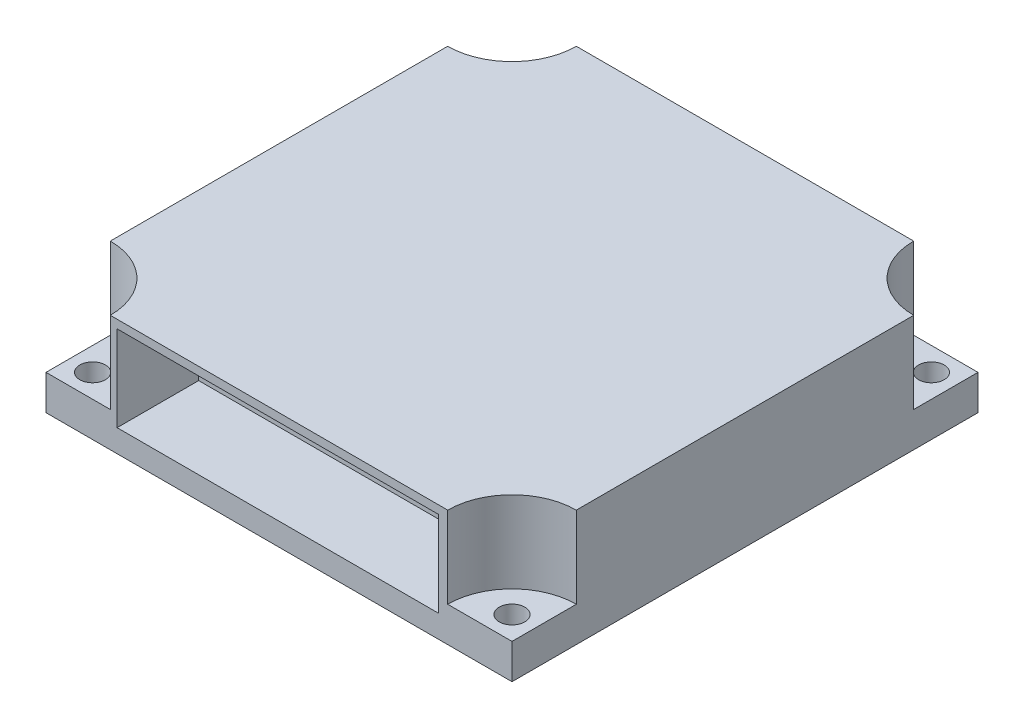
ISO-10303-21;
HEADER;
FILE_DESCRIPTION(('STEP AP214'),'2;1');
FILE_NAME('part.step','',(''),(''),'','','');
FILE_SCHEMA(('AUTOMOTIVE_DESIGN { 1 0 10303 214 1 1 1 1 }'));
ENDSEC;
DATA;
#1=APPLICATION_CONTEXT('core data for automotive mechanical design processes');
#2=APPLICATION_PROTOCOL_DEFINITION('international standard','automotive_design',2000,#1);
#3=PRODUCT_CONTEXT('',#1,'mechanical');
#4=PRODUCT('Part','Part','',(#3));
#5=PRODUCT_RELATED_PRODUCT_CATEGORY('part','',(#4));
#6=PRODUCT_DEFINITION_FORMATION('','',#4);
#7=PRODUCT_DEFINITION_CONTEXT('part definition',#1,'design');
#8=PRODUCT_DEFINITION('design','',#6,#7);
#9=PRODUCT_DEFINITION_SHAPE('','',#8);
#10=(LENGTH_UNIT() NAMED_UNIT(*) SI_UNIT(.MILLI.,.METRE.));
#11=(NAMED_UNIT(*) PLANE_ANGLE_UNIT() SI_UNIT($,.RADIAN.));
#12=(NAMED_UNIT(*) SI_UNIT($,.STERADIAN.) SOLID_ANGLE_UNIT());
#13=UNCERTAINTY_MEASURE_WITH_UNIT(LENGTH_MEASURE(1.E-05),#10,'distance_accuracy_value','');
#14=(GEOMETRIC_REPRESENTATION_CONTEXT(3) GLOBAL_UNCERTAINTY_ASSIGNED_CONTEXT((#13)) GLOBAL_UNIT_ASSIGNED_CONTEXT((#10,
#11,#12)) REPRESENTATION_CONTEXT('',''));
#15=CARTESIAN_POINT('',(0.,0.,0.));
#16=DIRECTION('',(0.,0.,1.));
#17=DIRECTION('',(1.,0.,0.));
#18=AXIS2_PLACEMENT_3D('',#15,#16,#17);
#19=CARTESIAN_POINT('',(0.,10.,0.));
#20=DIRECTION('',(0.,-1.,0.));
#21=DIRECTION('',(0.,0.,-1.));
#22=AXIS2_PLACEMENT_3D('',#19,#20,#21);
#23=PLANE('',#22);
#24=DIRECTION('',(0.,0.,1.));
#25=VECTOR('',#24,1.);
#26=CARTESIAN_POINT('',(0.,10.,0.));
#27=LINE('',#26,#25);
#28=CARTESIAN_POINT('',(0.,10.,-34.4807190282554));
#29=VERTEX_POINT('',#28);
#30=CARTESIAN_POINT('',(0.,10.,-5.51928097174457));
#31=VERTEX_POINT('',#30);
#32=EDGE_CURVE('E252',#29,#31,#27,.T.);
#33=ORIENTED_EDGE('',*,*,#32,.T.);
#34=CARTESIAN_POINT('',(0.,10.,0.));
#35=DIRECTION('',(0.,1.,0.));
#36=DIRECTION('',(0.,0.,-1.));
#37=AXIS2_PLACEMENT_3D('',#34,#35,#36);
#38=CIRCLE('',#37,5.51928097174457);
#39=CARTESIAN_POINT('',(5.51928097174457,10.,0.));
#40=VERTEX_POINT('',#39);
#41=EDGE_CURVE('E182',#40,#31,#38,.T.);
#42=ORIENTED_EDGE('',*,*,#41,.F.);
#43=DIRECTION('',(1.,0.,0.));
#44=VECTOR('',#43,1.);
#45=CARTESIAN_POINT('',(0.,10.,0.));
#46=LINE('',#45,#44);
#47=CARTESIAN_POINT('',(34.4807190282554,10.,0.));
#48=VERTEX_POINT('',#47);
#49=EDGE_CURVE('E255',#40,#48,#46,.T.);
#50=ORIENTED_EDGE('',*,*,#49,.T.);
#51=CARTESIAN_POINT('',(40.,10.,0.));
#52=DIRECTION('',(0.,1.,0.));
#53=DIRECTION('',(0.,0.,-1.));
#54=AXIS2_PLACEMENT_3D('',#51,#52,#53);
#55=CIRCLE('',#54,5.51928097174457);
#56=CARTESIAN_POINT('',(40.,10.,-5.51928097174455));
#57=VERTEX_POINT('',#56);
#58=EDGE_CURVE('E205',#57,#48,#55,.T.);
#59=ORIENTED_EDGE('',*,*,#58,.F.);
#60=DIRECTION('',(0.,0.,-1.));
#61=VECTOR('',#60,1.);
#62=CARTESIAN_POINT('',(40.,10.,0.));
#63=LINE('',#62,#61);
#64=CARTESIAN_POINT('',(40.,10.,-34.4807190282554));
#65=VERTEX_POINT('',#64);
#66=EDGE_CURVE('E259',#57,#65,#63,.T.);
#67=ORIENTED_EDGE('',*,*,#66,.T.);
#68=CARTESIAN_POINT('',(40.,10.,-40.));
#69=DIRECTION('',(0.,1.,0.));
#70=DIRECTION('',(0.,0.,-1.));
#71=AXIS2_PLACEMENT_3D('',#68,#69,#70);
#72=CIRCLE('',#71,5.51928097174457);
#73=CARTESIAN_POINT('',(34.4807190282554,10.,-40.));
#74=VERTEX_POINT('',#73);
#75=EDGE_CURVE('E189',#74,#65,#72,.T.);
#76=ORIENTED_EDGE('',*,*,#75,.F.);
#77=DIRECTION('',(-1.,0.,0.));
#78=VECTOR('',#77,1.);
#79=CARTESIAN_POINT('',(0.,10.,-40.));
#80=LINE('',#79,#78);
#81=CARTESIAN_POINT('',(5.51928097174457,10.,-40.));
#82=VERTEX_POINT('',#81);
#83=EDGE_CURVE('E262',#74,#82,#80,.T.);
#84=ORIENTED_EDGE('',*,*,#83,.T.);
#85=CARTESIAN_POINT('',(0.,10.,-40.));
#86=DIRECTION('',(0.,1.,0.));
#87=DIRECTION('',(0.,0.,-1.));
#88=AXIS2_PLACEMENT_3D('',#85,#86,#87);
#89=CIRCLE('',#88,5.51928097174457);
#90=EDGE_CURVE('E200',#29,#82,#89,.T.);
#91=ORIENTED_EDGE('',*,*,#90,.F.);
#92=EDGE_LOOP('',(#33,#42,#50,#59,#67,#76,#84,#91));
#93=FACE_BOUND('',#92,.T.);
#94=ADVANCED_FACE('F32',(#93),#23,.F.);
#95=CARTESIAN_POINT('',(0.,0.,0.));
#96=DIRECTION('',(0.,-1.,0.));
#97=DIRECTION('',(0.,0.,-1.));
#98=AXIS2_PLACEMENT_3D('',#95,#96,#97);
#99=PLANE('',#98);
#100=CARTESIAN_POINT('',(2.,0.,-1.99999999999999));
#101=DIRECTION('',(0.,1.,0.));
#102=DIRECTION('',(0.,0.,1.));
#103=AXIS2_PLACEMENT_3D('',#100,#101,#102);
#104=CIRCLE('',#103,1.1);
#105=CARTESIAN_POINT('',(2.,0.,-0.899999999999996));
#106=VERTEX_POINT('',#105);
#107=EDGE_CURVE('E242',#106,#106,#104,.T.);
#108=ORIENTED_EDGE('',*,*,#107,.T.);
#109=EDGE_LOOP('',(#108));
#110=FACE_BOUND('',#109,.T.);
#111=CARTESIAN_POINT('',(2.,0.,-38.));
#112=DIRECTION('',(0.,1.,0.));
#113=DIRECTION('',(0.,0.,1.));
#114=AXIS2_PLACEMENT_3D('',#111,#112,#113);
#115=CIRCLE('',#114,1.1);
#116=CARTESIAN_POINT('',(2.,0.,-36.9));
#117=VERTEX_POINT('',#116);
#118=EDGE_CURVE('E248',#117,#117,#115,.T.);
#119=ORIENTED_EDGE('',*,*,#118,.T.);
#120=EDGE_LOOP('',(#119));
#121=FACE_BOUND('',#120,.T.);
#122=DIRECTION('',(0.,0.,1.));
#123=VECTOR('',#122,1.);
#124=CARTESIAN_POINT('',(0.,0.,0.));
#125=LINE('',#124,#123);
#126=CARTESIAN_POINT('',(0.,0.,-40.));
#127=VERTEX_POINT('',#126);
#128=CARTESIAN_POINT('',(0.,0.,0.));
#129=VERTEX_POINT('',#128);
#130=EDGE_CURVE('E251',#127,#129,#125,.T.);
#131=ORIENTED_EDGE('',*,*,#130,.F.);
#132=DIRECTION('',(-1.,0.,0.));
#133=VECTOR('',#132,1.);
#134=CARTESIAN_POINT('',(0.,0.,-40.));
#135=LINE('',#134,#133);
#136=CARTESIAN_POINT('',(40.,0.,-40.));
#137=VERTEX_POINT('',#136);
#138=EDGE_CURVE('E256',#137,#127,#135,.T.);
#139=ORIENTED_EDGE('',*,*,#138,.F.);
#140=DIRECTION('',(0.,0.,-1.));
#141=VECTOR('',#140,1.);
#142=CARTESIAN_POINT('',(40.,0.,0.));
#143=LINE('',#142,#141);
#144=CARTESIAN_POINT('',(40.,0.,0.));
#145=VERTEX_POINT('',#144);
#146=EDGE_CURVE('E271',#145,#137,#143,.T.);
#147=ORIENTED_EDGE('',*,*,#146,.F.);
#148=DIRECTION('',(1.,0.,0.));
#149=VECTOR('',#148,1.);
#150=CARTESIAN_POINT('',(0.,0.,0.));
#151=LINE('',#150,#149);
#152=EDGE_CURVE('E268',#129,#145,#151,.T.);
#153=ORIENTED_EDGE('',*,*,#152,.F.);
#154=EDGE_LOOP('',(#131,#139,#147,#153));
#155=FACE_BOUND('',#154,.T.);
#156=CARTESIAN_POINT('',(38.,0.,-38.));
#157=DIRECTION('',(0.,1.,0.));
#158=DIRECTION('',(0.,0.,1.));
#159=AXIS2_PLACEMENT_3D('',#156,#157,#158);
#160=CIRCLE('',#159,1.1);
#161=CARTESIAN_POINT('',(38.,0.,-36.9));
#162=VERTEX_POINT('',#161);
#163=EDGE_CURVE('E245',#162,#162,#160,.T.);
#164=ORIENTED_EDGE('',*,*,#163,.T.);
#165=EDGE_LOOP('',(#164));
#166=FACE_BOUND('',#165,.T.);
#167=CARTESIAN_POINT('',(38.,0.,-1.99999999999999));
#168=DIRECTION('',(0.,1.,0.));
#169=DIRECTION('',(0.,0.,1.));
#170=AXIS2_PLACEMENT_3D('',#167,#168,#169);
#171=CIRCLE('',#170,1.1);
#172=CARTESIAN_POINT('',(38.,0.,-0.899999999999996));
#173=VERTEX_POINT('',#172);
#174=EDGE_CURVE('E239',#173,#173,#171,.T.);
#175=ORIENTED_EDGE('',*,*,#174,.T.);
#176=EDGE_LOOP('',(#175));
#177=FACE_BOUND('',#176,.T.);
#178=ADVANCED_FACE('F302',(#110,#121,#155,#166,#177),#99,.T.);
#179=CARTESIAN_POINT('',(0.,10.,0.));
#180=DIRECTION('',(1.,0.,0.));
#181=DIRECTION('',(0.,0.,-1.));
#182=AXIS2_PLACEMENT_3D('',#179,#180,#181);
#183=PLANE('',#182);
#184=DIRECTION('',(0.,0.,1.));
#185=VECTOR('',#184,1.);
#186=CARTESIAN_POINT('',(0.,3.,-5.51928097174457));
#187=LINE('',#186,#185);
#188=CARTESIAN_POINT('',(0.,3.,-5.51928097174457));
#189=VERTEX_POINT('',#188);
#190=CARTESIAN_POINT('',(0.,3.,0.));
#191=VERTEX_POINT('',#190);
#192=EDGE_CURVE('E57',#189,#191,#187,.T.);
#193=ORIENTED_EDGE('',*,*,#192,.F.);
#194=DIRECTION('',(0.,1.,0.));
#195=VECTOR('',#194,1.);
#196=CARTESIAN_POINT('',(0.,3.,-5.51928097174457));
#197=LINE('',#196,#195);
#198=EDGE_CURVE('E212',#189,#31,#197,.T.);
#199=ORIENTED_EDGE('',*,*,#198,.T.);
#200=ORIENTED_EDGE('',*,*,#32,.F.);
#201=DIRECTION('',(0.,1.,0.));
#202=VECTOR('',#201,1.);
#203=CARTESIAN_POINT('',(0.,3.,-34.4807190282554));
#204=LINE('',#203,#202);
#205=CARTESIAN_POINT('',(0.,3.,-34.4807190282554));
#206=VERTEX_POINT('',#205);
#207=EDGE_CURVE('E232',#206,#29,#204,.T.);
#208=ORIENTED_EDGE('',*,*,#207,.F.);
#209=DIRECTION('',(0.,0.,1.));
#210=VECTOR('',#209,1.);
#211=CARTESIAN_POINT('',(0.,3.,-40.));
#212=LINE('',#211,#210);
#213=CARTESIAN_POINT('',(0.,3.,-40.));
#214=VERTEX_POINT('',#213);
#215=EDGE_CURVE('E228',#214,#206,#212,.T.);
#216=ORIENTED_EDGE('',*,*,#215,.F.);
#217=DIRECTION('',(0.,-1.,0.));
#218=VECTOR('',#217,1.);
#219=CARTESIAN_POINT('',(0.,10.,-40.));
#220=LINE('',#219,#218);
#221=EDGE_CURVE('E265',#214,#127,#220,.T.);
#222=ORIENTED_EDGE('',*,*,#221,.T.);
#223=ORIENTED_EDGE('',*,*,#130,.T.);
#224=DIRECTION('',(0.,-1.,0.));
#225=VECTOR('',#224,1.);
#226=CARTESIAN_POINT('',(0.,10.,0.));
#227=LINE('',#226,#225);
#228=EDGE_CURVE('E11',#191,#129,#227,.T.);
#229=ORIENTED_EDGE('',*,*,#228,.F.);
#230=EDGE_LOOP('',(#193,#199,#200,#208,#216,#222,#223,#229));
#231=FACE_BOUND('',#230,.T.);
#232=ADVANCED_FACE('F34',(#231),#183,.F.);
#233=CARTESIAN_POINT('',(0.,10.,0.));
#234=DIRECTION('',(0.,0.,-1.));
#235=DIRECTION('',(-1.,0.,0.));
#236=AXIS2_PLACEMENT_3D('',#233,#234,#235);
#237=PLANE('',#236);
#238=DIRECTION('',(1.,0.,0.));
#239=VECTOR('',#238,1.);
#240=CARTESIAN_POINT('',(6.10411725381788,1.93881444528188,0.));
#241=LINE('',#240,#239);
#242=CARTESIAN_POINT('',(6.10411725381788,1.93881444528188,0.));
#243=VERTEX_POINT('',#242);
#244=CARTESIAN_POINT('',(33.6752905984774,1.93881444528188,0.));
#245=VERTEX_POINT('',#244);
#246=EDGE_CURVE('E176',#243,#245,#241,.T.);
#247=ORIENTED_EDGE('',*,*,#246,.F.);
#248=DIRECTION('',(0.,-1.,0.));
#249=VECTOR('',#248,1.);
#250=CARTESIAN_POINT('',(6.10411725381788,9.28673716728667,0.));
#251=LINE('',#250,#249);
#252=CARTESIAN_POINT('',(6.10411725381788,9.28673716728667,0.));
#253=VERTEX_POINT('',#252);
#254=EDGE_CURVE('E49',#253,#243,#251,.T.);
#255=ORIENTED_EDGE('',*,*,#254,.F.);
#256=DIRECTION('',(-1.,0.,0.));
#257=VECTOR('',#256,1.);
#258=CARTESIAN_POINT('',(6.10411725381788,9.28673716728667,0.));
#259=LINE('',#258,#257);
#260=CARTESIAN_POINT('',(33.6752905984774,9.28673716728667,0.));
#261=VERTEX_POINT('',#260);
#262=EDGE_CURVE('E167',#261,#253,#259,.T.);
#263=ORIENTED_EDGE('',*,*,#262,.F.);
#264=DIRECTION('',(0.,1.,0.));
#265=VECTOR('',#264,1.);
#266=CARTESIAN_POINT('',(33.6752905984774,9.28673716728667,0.));
#267=LINE('',#266,#265);
#268=EDGE_CURVE('E170',#245,#261,#267,.T.);
#269=ORIENTED_EDGE('',*,*,#268,.F.);
#270=EDGE_LOOP('',(#247,#255,#263,#269));
#271=FACE_BOUND('',#270,.T.);
#272=ORIENTED_EDGE('',*,*,#49,.F.);
#273=DIRECTION('',(0.,1.,0.));
#274=VECTOR('',#273,1.);
#275=CARTESIAN_POINT('',(5.51928097174457,3.,0.));
#276=LINE('',#275,#274);
#277=CARTESIAN_POINT('',(5.51928097174457,3.,0.));
#278=VERTEX_POINT('',#277);
#279=EDGE_CURVE('E221',#278,#40,#276,.T.);
#280=ORIENTED_EDGE('',*,*,#279,.F.);
#281=DIRECTION('',(1.,0.,0.));
#282=VECTOR('',#281,1.);
#283=CARTESIAN_POINT('',(0.,3.,0.));
#284=LINE('',#283,#282);
#285=EDGE_CURVE('E217',#191,#278,#284,.T.);
#286=ORIENTED_EDGE('',*,*,#285,.F.);
#287=ORIENTED_EDGE('',*,*,#228,.T.);
#288=ORIENTED_EDGE('',*,*,#152,.T.);
#289=DIRECTION('',(0.,-1.,0.));
#290=VECTOR('',#289,1.);
#291=CARTESIAN_POINT('',(40.,10.,0.));
#292=LINE('',#291,#290);
#293=CARTESIAN_POINT('',(40.,3.,0.));
#294=VERTEX_POINT('',#293);
#295=EDGE_CURVE('E41',#294,#145,#292,.T.);
#296=ORIENTED_EDGE('',*,*,#295,.F.);
#297=DIRECTION('',(1.,0.,0.));
#298=VECTOR('',#297,1.);
#299=CARTESIAN_POINT('',(34.4807190282554,3.,0.));
#300=LINE('',#299,#298);
#301=CARTESIAN_POINT('',(34.4807190282554,3.,0.));
#302=VERTEX_POINT('',#301);
#303=EDGE_CURVE('E202',#302,#294,#300,.T.);
#304=ORIENTED_EDGE('',*,*,#303,.F.);
#305=DIRECTION('',(0.,1.,0.));
#306=VECTOR('',#305,1.);
#307=CARTESIAN_POINT('',(34.4807190282554,3.,0.));
#308=LINE('',#307,#306);
#309=EDGE_CURVE('E196',#302,#48,#308,.T.);
#310=ORIENTED_EDGE('',*,*,#309,.T.);
#311=EDGE_LOOP('',(#272,#280,#286,#287,#288,#296,#304,#310));
#312=FACE_BOUND('',#311,.T.);
#313=ADVANCED_FACE('F344',(#271,#312),#237,.F.);
#314=CARTESIAN_POINT('',(40.,10.,0.));
#315=DIRECTION('',(-1.,0.,0.));
#316=DIRECTION('',(0.,0.,1.));
#317=AXIS2_PLACEMENT_3D('',#314,#315,#316);
#318=PLANE('',#317);
#319=ORIENTED_EDGE('',*,*,#66,.F.);
#320=DIRECTION('',(0.,1.,0.));
#321=VECTOR('',#320,1.);
#322=CARTESIAN_POINT('',(40.,3.,-5.51928097174455));
#323=LINE('',#322,#321);
#324=CARTESIAN_POINT('',(40.,3.,-5.51928097174455));
#325=VERTEX_POINT('',#324);
#326=EDGE_CURVE('E210',#325,#57,#323,.T.);
#327=ORIENTED_EDGE('',*,*,#326,.F.);
#328=DIRECTION('',(0.,0.,-1.));
#329=VECTOR('',#328,1.);
#330=CARTESIAN_POINT('',(40.,3.,0.));
#331=LINE('',#330,#329);
#332=EDGE_CURVE('E204',#294,#325,#331,.T.);
#333=ORIENTED_EDGE('',*,*,#332,.F.);
#334=ORIENTED_EDGE('',*,*,#295,.T.);
#335=ORIENTED_EDGE('',*,*,#146,.T.);
#336=DIRECTION('',(0.,-1.,0.));
#337=VECTOR('',#336,1.);
#338=CARTESIAN_POINT('',(40.,10.,-40.));
#339=LINE('',#338,#337);
#340=CARTESIAN_POINT('',(40.,3.,-40.));
#341=VERTEX_POINT('',#340);
#342=EDGE_CURVE('E277',#341,#137,#339,.T.);
#343=ORIENTED_EDGE('',*,*,#342,.F.);
#344=DIRECTION('',(0.,0.,-1.));
#345=VECTOR('',#344,1.);
#346=CARTESIAN_POINT('',(40.,3.,-34.4807190282554));
#347=LINE('',#346,#345);
#348=CARTESIAN_POINT('',(40.,3.,-34.4807190282554));
#349=VERTEX_POINT('',#348);
#350=EDGE_CURVE('E186',#349,#341,#347,.T.);
#351=ORIENTED_EDGE('',*,*,#350,.F.);
#352=DIRECTION('',(0.,1.,0.));
#353=VECTOR('',#352,1.);
#354=CARTESIAN_POINT('',(40.,3.,-34.4807190282554));
#355=LINE('',#354,#353);
#356=EDGE_CURVE('E197',#349,#65,#355,.T.);
#357=ORIENTED_EDGE('',*,*,#356,.T.);
#358=EDGE_LOOP('',(#319,#327,#333,#334,#335,#343,#351,#357));
#359=FACE_BOUND('',#358,.T.);
#360=ADVANCED_FACE('F341',(#359),#318,.F.);
#361=CARTESIAN_POINT('',(0.,10.,-40.));
#362=DIRECTION('',(0.,0.,1.));
#363=DIRECTION('',(1.,0.,0.));
#364=AXIS2_PLACEMENT_3D('',#361,#362,#363);
#365=PLANE('',#364);
#366=ORIENTED_EDGE('',*,*,#83,.F.);
#367=DIRECTION('',(0.,1.,0.));
#368=VECTOR('',#367,1.);
#369=CARTESIAN_POINT('',(34.4807190282554,3.,-40.));
#370=LINE('',#369,#368);
#371=CARTESIAN_POINT('',(34.4807190282554,3.,-40.));
#372=VERTEX_POINT('',#371);
#373=EDGE_CURVE('E194',#372,#74,#370,.T.);
#374=ORIENTED_EDGE('',*,*,#373,.F.);
#375=DIRECTION('',(-1.,0.,0.));
#376=VECTOR('',#375,1.);
#377=CARTESIAN_POINT('',(40.,3.,-40.));
#378=LINE('',#377,#376);
#379=EDGE_CURVE('E188',#341,#372,#378,.T.);
#380=ORIENTED_EDGE('',*,*,#379,.F.);
#381=ORIENTED_EDGE('',*,*,#342,.T.);
#382=ORIENTED_EDGE('',*,*,#138,.T.);
#383=ORIENTED_EDGE('',*,*,#221,.F.);
#384=DIRECTION('',(-1.,0.,0.));
#385=VECTOR('',#384,1.);
#386=CARTESIAN_POINT('',(5.51928097174459,3.,-40.));
#387=LINE('',#386,#385);
#388=CARTESIAN_POINT('',(5.51928097174457,3.,-40.));
#389=VERTEX_POINT('',#388);
#390=EDGE_CURVE('E226',#389,#214,#387,.T.);
#391=ORIENTED_EDGE('',*,*,#390,.F.);
#392=DIRECTION('',(0.,1.,0.));
#393=VECTOR('',#392,1.);
#394=CARTESIAN_POINT('',(5.51928097174457,3.,-40.));
#395=LINE('',#394,#393);
#396=EDGE_CURVE('E234',#389,#82,#395,.T.);
#397=ORIENTED_EDGE('',*,*,#396,.T.);
#398=EDGE_LOOP('',(#366,#374,#380,#381,#382,#383,#391,#397));
#399=FACE_BOUND('',#398,.T.);
#400=ADVANCED_FACE('F298',(#399),#365,.F.);
#401=CARTESIAN_POINT('',(2.,10.,-38.));
#402=DIRECTION('',(0.,-1.,0.));
#403=DIRECTION('',(0.,0.,-1.));
#404=AXIS2_PLACEMENT_3D('',#401,#402,#403);
#405=CYLINDRICAL_SURFACE('',#404,1.1);
#406=CARTESIAN_POINT('',(2.,3.,-38.));
#407=DIRECTION('',(0.,-1.,0.));
#408=DIRECTION('',(0.,0.,-1.));
#409=AXIS2_PLACEMENT_3D('',#406,#407,#408);
#410=CIRCLE('',#409,1.1);
#411=CARTESIAN_POINT('',(2.,3.,-39.1));
#412=VERTEX_POINT('',#411);
#413=EDGE_CURVE('E36',#412,#412,#410,.T.);
#414=ORIENTED_EDGE('',*,*,#413,.F.);
#415=EDGE_LOOP('',(#414));
#416=FACE_BOUND('',#415,.T.);
#417=ORIENTED_EDGE('',*,*,#118,.F.);
#418=EDGE_LOOP('',(#417));
#419=FACE_BOUND('',#418,.T.);
#420=ADVANCED_FACE('F294',(#416,#419),#405,.F.);
#421=CARTESIAN_POINT('',(38.,10.,-38.));
#422=DIRECTION('',(0.,-1.,0.));
#423=DIRECTION('',(0.,0.,-1.));
#424=AXIS2_PLACEMENT_3D('',#421,#422,#423);
#425=CYLINDRICAL_SURFACE('',#424,1.1);
#426=CARTESIAN_POINT('',(38.,3.,-38.));
#427=DIRECTION('',(0.,-1.,0.));
#428=DIRECTION('',(0.,0.,-1.));
#429=AXIS2_PLACEMENT_3D('',#426,#427,#428);
#430=CIRCLE('',#429,1.1);
#431=CARTESIAN_POINT('',(38.,3.,-39.1));
#432=VERTEX_POINT('',#431);
#433=EDGE_CURVE('E284',#432,#432,#430,.T.);
#434=ORIENTED_EDGE('',*,*,#433,.F.);
#435=EDGE_LOOP('',(#434));
#436=FACE_BOUND('',#435,.T.);
#437=ORIENTED_EDGE('',*,*,#163,.F.);
#438=EDGE_LOOP('',(#437));
#439=FACE_BOUND('',#438,.T.);
#440=ADVANCED_FACE('F297',(#436,#439),#425,.F.);
#441=CARTESIAN_POINT('',(2.,10.,-1.99999999999999));
#442=DIRECTION('',(0.,-1.,0.));
#443=DIRECTION('',(0.,0.,-1.));
#444=AXIS2_PLACEMENT_3D('',#441,#442,#443);
#445=CYLINDRICAL_SURFACE('',#444,1.1);
#446=CARTESIAN_POINT('',(2.,3.,-1.99999999999999));
#447=DIRECTION('',(0.,-1.,0.));
#448=DIRECTION('',(0.,0.,-1.));
#449=AXIS2_PLACEMENT_3D('',#446,#447,#448);
#450=CIRCLE('',#449,1.1);
#451=CARTESIAN_POINT('',(2.,3.,-3.09999999999999));
#452=VERTEX_POINT('',#451);
#453=EDGE_CURVE('E282',#452,#452,#450,.T.);
#454=ORIENTED_EDGE('',*,*,#453,.F.);
#455=EDGE_LOOP('',(#454));
#456=FACE_BOUND('',#455,.T.);
#457=ORIENTED_EDGE('',*,*,#107,.F.);
#458=EDGE_LOOP('',(#457));
#459=FACE_BOUND('',#458,.T.);
#460=ADVANCED_FACE('F318',(#456,#459),#445,.F.);
#461=CARTESIAN_POINT('',(38.,10.,-1.99999999999999));
#462=DIRECTION('',(0.,-1.,0.));
#463=DIRECTION('',(0.,0.,-1.));
#464=AXIS2_PLACEMENT_3D('',#461,#462,#463);
#465=CYLINDRICAL_SURFACE('',#464,1.1);
#466=CARTESIAN_POINT('',(38.,3.,-1.99999999999999));
#467=DIRECTION('',(0.,-1.,0.));
#468=DIRECTION('',(0.,0.,-1.));
#469=AXIS2_PLACEMENT_3D('',#466,#467,#468);
#470=CIRCLE('',#469,1.1);
#471=CARTESIAN_POINT('',(38.,3.,-3.09999999999999));
#472=VERTEX_POINT('',#471);
#473=EDGE_CURVE('E237',#472,#472,#470,.T.);
#474=ORIENTED_EDGE('',*,*,#473,.F.);
#475=EDGE_LOOP('',(#474));
#476=FACE_BOUND('',#475,.T.);
#477=ORIENTED_EDGE('',*,*,#174,.F.);
#478=EDGE_LOOP('',(#477));
#479=FACE_BOUND('',#478,.T.);
#480=ADVANCED_FACE('F315',(#476,#479),#465,.F.);
#481=CARTESIAN_POINT('',(40.,3.,0.));
#482=DIRECTION('',(0.,1.,0.));
#483=DIRECTION('',(0.,0.,1.));
#484=AXIS2_PLACEMENT_3D('',#481,#482,#483);
#485=CYLINDRICAL_SURFACE('',#484,5.51928097174457);
#486=ORIENTED_EDGE('',*,*,#58,.T.);
#487=ORIENTED_EDGE('',*,*,#309,.F.);
#488=CARTESIAN_POINT('',(40.,3.,0.));
#489=DIRECTION('',(0.,1.,0.));
#490=DIRECTION('',(0.,0.,-1.));
#491=AXIS2_PLACEMENT_3D('',#488,#489,#490);
#492=CIRCLE('',#491,5.51928097174457);
#493=EDGE_CURVE('E207',#325,#302,#492,.T.);
#494=ORIENTED_EDGE('',*,*,#493,.F.);
#495=ORIENTED_EDGE('',*,*,#326,.T.);
#496=EDGE_LOOP('',(#486,#487,#494,#495));
#497=FACE_BOUND('',#496,.T.);
#498=ADVANCED_FACE('F317',(#497),#485,.F.);
#499=CARTESIAN_POINT('',(40.,3.,0.));
#500=DIRECTION('',(0.,-1.,0.));
#501=DIRECTION('',(0.,0.,-1.));
#502=AXIS2_PLACEMENT_3D('',#499,#500,#501);
#503=PLANE('',#502);
#504=ORIENTED_EDGE('',*,*,#473,.T.);
#505=EDGE_LOOP('',(#504));
#506=FACE_BOUND('',#505,.T.);
#507=ORIENTED_EDGE('',*,*,#303,.T.);
#508=ORIENTED_EDGE('',*,*,#332,.T.);
#509=ORIENTED_EDGE('',*,*,#493,.T.);
#510=EDGE_LOOP('',(#507,#508,#509));
#511=FACE_BOUND('',#510,.T.);
#512=ADVANCED_FACE('F325',(#506,#511),#503,.F.);
#513=CARTESIAN_POINT('',(0.,3.,0.));
#514=DIRECTION('',(0.,1.,0.));
#515=DIRECTION('',(0.,0.,1.));
#516=AXIS2_PLACEMENT_3D('',#513,#514,#515);
#517=CYLINDRICAL_SURFACE('',#516,5.51928097174457);
#518=ORIENTED_EDGE('',*,*,#41,.T.);
#519=ORIENTED_EDGE('',*,*,#198,.F.);
#520=CARTESIAN_POINT('',(0.,3.,0.));
#521=DIRECTION('',(0.,1.,0.));
#522=DIRECTION('',(0.,0.,-1.));
#523=AXIS2_PLACEMENT_3D('',#520,#521,#522);
#524=CIRCLE('',#523,5.51928097174457);
#525=EDGE_CURVE('E219',#278,#189,#524,.T.);
#526=ORIENTED_EDGE('',*,*,#525,.F.);
#527=ORIENTED_EDGE('',*,*,#279,.T.);
#528=EDGE_LOOP('',(#518,#519,#526,#527));
#529=FACE_BOUND('',#528,.T.);
#530=ADVANCED_FACE('F363',(#529),#517,.F.);
#531=CARTESIAN_POINT('',(0.,3.,0.));
#532=DIRECTION('',(0.,-1.,0.));
#533=DIRECTION('',(0.,0.,-1.));
#534=AXIS2_PLACEMENT_3D('',#531,#532,#533);
#535=PLANE('',#534);
#536=ORIENTED_EDGE('',*,*,#453,.T.);
#537=EDGE_LOOP('',(#536));
#538=FACE_BOUND('',#537,.T.);
#539=ORIENTED_EDGE('',*,*,#192,.T.);
#540=ORIENTED_EDGE('',*,*,#285,.T.);
#541=ORIENTED_EDGE('',*,*,#525,.T.);
#542=EDGE_LOOP('',(#539,#540,#541));
#543=FACE_BOUND('',#542,.T.);
#544=ADVANCED_FACE('F392',(#538,#543),#535,.F.);
#545=CARTESIAN_POINT('',(40.,3.,-40.));
#546=DIRECTION('',(0.,1.,0.));
#547=DIRECTION('',(0.,0.,1.));
#548=AXIS2_PLACEMENT_3D('',#545,#546,#547);
#549=CYLINDRICAL_SURFACE('',#548,5.51928097174457);
#550=ORIENTED_EDGE('',*,*,#75,.T.);
#551=ORIENTED_EDGE('',*,*,#356,.F.);
#552=CARTESIAN_POINT('',(40.,3.,-40.));
#553=DIRECTION('',(0.,1.,0.));
#554=DIRECTION('',(0.,0.,-1.));
#555=AXIS2_PLACEMENT_3D('',#552,#553,#554);
#556=CIRCLE('',#555,5.51928097174457);
#557=EDGE_CURVE('E191',#372,#349,#556,.T.);
#558=ORIENTED_EDGE('',*,*,#557,.F.);
#559=ORIENTED_EDGE('',*,*,#373,.T.);
#560=EDGE_LOOP('',(#550,#551,#558,#559));
#561=FACE_BOUND('',#560,.T.);
#562=ADVANCED_FACE('F390',(#561),#549,.F.);
#563=CARTESIAN_POINT('',(40.,3.,-40.));
#564=DIRECTION('',(0.,-1.,0.));
#565=DIRECTION('',(0.,0.,-1.));
#566=AXIS2_PLACEMENT_3D('',#563,#564,#565);
#567=PLANE('',#566);
#568=ORIENTED_EDGE('',*,*,#433,.T.);
#569=EDGE_LOOP('',(#568));
#570=FACE_BOUND('',#569,.T.);
#571=ORIENTED_EDGE('',*,*,#350,.T.);
#572=ORIENTED_EDGE('',*,*,#379,.T.);
#573=ORIENTED_EDGE('',*,*,#557,.T.);
#574=EDGE_LOOP('',(#571,#572,#573));
#575=FACE_BOUND('',#574,.T.);
#576=ADVANCED_FACE('F389',(#570,#575),#567,.F.);
#577=CARTESIAN_POINT('',(0.,3.,-40.));
#578=DIRECTION('',(0.,1.,0.));
#579=DIRECTION('',(0.,0.,1.));
#580=AXIS2_PLACEMENT_3D('',#577,#578,#579);
#581=CYLINDRICAL_SURFACE('',#580,5.51928097174457);
#582=ORIENTED_EDGE('',*,*,#90,.T.);
#583=ORIENTED_EDGE('',*,*,#396,.F.);
#584=CARTESIAN_POINT('',(0.,3.,-40.));
#585=DIRECTION('',(0.,1.,0.));
#586=DIRECTION('',(0.,0.,-1.));
#587=AXIS2_PLACEMENT_3D('',#584,#585,#586);
#588=CIRCLE('',#587,5.51928097174457);
#589=EDGE_CURVE('E230',#206,#389,#588,.T.);
#590=ORIENTED_EDGE('',*,*,#589,.F.);
#591=ORIENTED_EDGE('',*,*,#207,.T.);
#592=EDGE_LOOP('',(#582,#583,#590,#591));
#593=FACE_BOUND('',#592,.T.);
#594=ADVANCED_FACE('F385',(#593),#581,.F.);
#595=CARTESIAN_POINT('',(0.,3.,-40.));
#596=DIRECTION('',(0.,-1.,0.));
#597=DIRECTION('',(0.,0.,-1.));
#598=AXIS2_PLACEMENT_3D('',#595,#596,#597);
#599=PLANE('',#598);
#600=ORIENTED_EDGE('',*,*,#413,.T.);
#601=EDGE_LOOP('',(#600));
#602=FACE_BOUND('',#601,.T.);
#603=ORIENTED_EDGE('',*,*,#390,.T.);
#604=ORIENTED_EDGE('',*,*,#215,.T.);
#605=ORIENTED_EDGE('',*,*,#589,.T.);
#606=EDGE_LOOP('',(#603,#604,#605));
#607=FACE_BOUND('',#606,.T.);
#608=ADVANCED_FACE('F291',(#602,#607),#599,.F.);
#609=CARTESIAN_POINT('',(6.10411725381788,9.28673716728667,-7.));
#610=DIRECTION('',(-1.,0.,0.));
#611=DIRECTION('',(0.,0.,1.));
#612=AXIS2_PLACEMENT_3D('',#609,#610,#611);
#613=PLANE('',#612);
#614=ORIENTED_EDGE('',*,*,#254,.T.);
#615=DIRECTION('',(0.,0.,1.));
#616=VECTOR('',#615,1.);
#617=CARTESIAN_POINT('',(6.10411725381788,1.93881444528188,-7.));
#618=LINE('',#617,#616);
#619=CARTESIAN_POINT('',(6.10411725381788,1.93881444528188,-7.));
#620=VERTEX_POINT('',#619);
#621=EDGE_CURVE('E145',#620,#243,#618,.T.);
#622=ORIENTED_EDGE('',*,*,#621,.F.);
#623=DIRECTION('',(0.,-1.,0.));
#624=VECTOR('',#623,1.);
#625=CARTESIAN_POINT('',(6.10411725381788,9.28673716728667,-7.));
#626=LINE('',#625,#624);
#627=CARTESIAN_POINT('',(6.10411725381788,9.28673716728667,-7.));
#628=VERTEX_POINT('',#627);
#629=EDGE_CURVE('E149',#628,#620,#626,.T.);
#630=ORIENTED_EDGE('',*,*,#629,.F.);
#631=DIRECTION('',(0.,0.,1.));
#632=VECTOR('',#631,1.);
#633=CARTESIAN_POINT('',(6.10411725381788,9.28673716728667,-7.));
#634=LINE('',#633,#632);
#635=EDGE_CURVE('E180',#628,#253,#634,.T.);
#636=ORIENTED_EDGE('',*,*,#635,.T.);
#637=EDGE_LOOP('',(#614,#622,#630,#636));
#638=FACE_BOUND('',#637,.T.);
#639=ADVANCED_FACE('F147',(#638),#613,.F.);
#640=CARTESIAN_POINT('',(6.10411725381788,9.28673716728667,-7.));
#641=DIRECTION('',(0.,1.,0.));
#642=DIRECTION('',(0.,0.,1.));
#643=AXIS2_PLACEMENT_3D('',#640,#641,#642);
#644=PLANE('',#643);
#645=ORIENTED_EDGE('',*,*,#262,.T.);
#646=ORIENTED_EDGE('',*,*,#635,.F.);
#647=DIRECTION('',(-1.,0.,0.));
#648=VECTOR('',#647,1.);
#649=CARTESIAN_POINT('',(6.10411725381788,9.28673716728667,-7.));
#650=LINE('',#649,#648);
#651=CARTESIAN_POINT('',(33.6752905984774,9.28673716728667,-7.));
#652=VERTEX_POINT('',#651);
#653=EDGE_CURVE('E155',#652,#628,#650,.T.);
#654=ORIENTED_EDGE('',*,*,#653,.F.);
#655=DIRECTION('',(0.,0.,1.));
#656=VECTOR('',#655,1.);
#657=CARTESIAN_POINT('',(33.6752905984774,9.28673716728667,-7.));
#658=LINE('',#657,#656);
#659=EDGE_CURVE('E183',#652,#261,#658,.T.);
#660=ORIENTED_EDGE('',*,*,#659,.T.);
#661=EDGE_LOOP('',(#645,#646,#654,#660));
#662=FACE_BOUND('',#661,.T.);
#663=ADVANCED_FACE('F424',(#662),#644,.F.);
#664=CARTESIAN_POINT('',(33.6752905984774,9.28673716728667,-7.));
#665=DIRECTION('',(1.,0.,0.));
#666=DIRECTION('',(0.,0.,-1.));
#667=AXIS2_PLACEMENT_3D('',#664,#665,#666);
#668=PLANE('',#667);
#669=ORIENTED_EDGE('',*,*,#268,.T.);
#670=ORIENTED_EDGE('',*,*,#659,.F.);
#671=DIRECTION('',(0.,1.,0.));
#672=VECTOR('',#671,1.);
#673=CARTESIAN_POINT('',(33.6752905984774,9.28673716728667,-7.));
#674=LINE('',#673,#672);
#675=CARTESIAN_POINT('',(33.6752905984774,1.93881444528188,-7.));
#676=VERTEX_POINT('',#675);
#677=EDGE_CURVE('E163',#676,#652,#674,.T.);
#678=ORIENTED_EDGE('',*,*,#677,.F.);
#679=DIRECTION('',(0.,0.,1.));
#680=VECTOR('',#679,1.);
#681=CARTESIAN_POINT('',(33.6752905984774,1.93881444528188,-7.));
#682=LINE('',#681,#680);
#683=EDGE_CURVE('E154',#676,#245,#682,.T.);
#684=ORIENTED_EDGE('',*,*,#683,.T.);
#685=EDGE_LOOP('',(#669,#670,#678,#684));
#686=FACE_BOUND('',#685,.T.);
#687=ADVANCED_FACE('F430',(#686),#668,.F.);
#688=CARTESIAN_POINT('',(6.10411725381788,1.93881444528188,-7.));
#689=DIRECTION('',(0.,-1.,0.));
#690=DIRECTION('',(0.,0.,-1.));
#691=AXIS2_PLACEMENT_3D('',#688,#689,#690);
#692=PLANE('',#691);
#693=ORIENTED_EDGE('',*,*,#246,.T.);
#694=ORIENTED_EDGE('',*,*,#683,.F.);
#695=DIRECTION('',(1.,0.,0.));
#696=VECTOR('',#695,1.);
#697=CARTESIAN_POINT('',(6.10411725381788,1.93881444528188,-7.));
#698=LINE('',#697,#696);
#699=EDGE_CURVE('E158',#620,#676,#698,.T.);
#700=ORIENTED_EDGE('',*,*,#699,.F.);
#701=ORIENTED_EDGE('',*,*,#621,.T.);
#702=EDGE_LOOP('',(#693,#694,#700,#701));
#703=FACE_BOUND('',#702,.T.);
#704=ADVANCED_FACE('F159',(#703),#692,.F.);
#705=CARTESIAN_POINT('',(0.,0.,-7.));
#706=DIRECTION('',(0.,0.,1.));
#707=DIRECTION('',(1.,0.,0.));
#708=AXIS2_PLACEMENT_3D('',#705,#706,#707);
#709=PLANE('',#708);
#710=ORIENTED_EDGE('',*,*,#629,.T.);
#711=ORIENTED_EDGE('',*,*,#699,.T.);
#712=ORIENTED_EDGE('',*,*,#677,.T.);
#713=ORIENTED_EDGE('',*,*,#653,.T.);
#714=EDGE_LOOP('',(#710,#711,#712,#713));
#715=FACE_BOUND('',#714,.T.);
#716=ADVANCED_FACE('F165',(#715),#709,.T.);
#717=CLOSED_SHELL('',(#94,#178,#232,#313,#360,#400,#420,#440,#460,#480,#498,#512,#530,#544,#562,
#576,#594,#608,#639,#663,#687,#704,#716));
#718=MANIFOLD_SOLID_BREP('B2',#717);
#719=ADVANCED_BREP_SHAPE_REPRESENTATION('',(#18,#718),#14);
#720=SHAPE_DEFINITION_REPRESENTATION(#9,#719);
ENDSEC;
END-ISO-10303-21;
